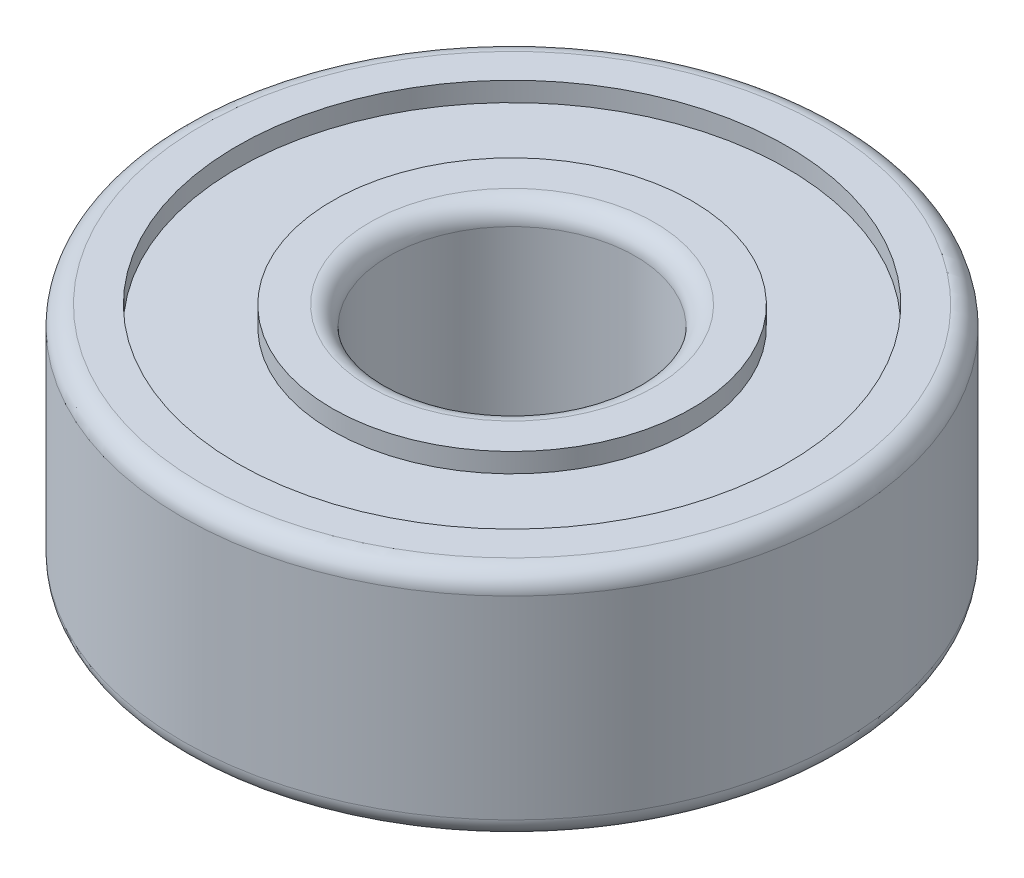
ISO-10303-21;
HEADER;
FILE_DESCRIPTION(('STEP AP214'),'2;1');
FILE_NAME('part.step','',(''),(''),'','','');
FILE_SCHEMA(('AUTOMOTIVE_DESIGN { 1 0 10303 214 1 1 1 1 }'));
ENDSEC;
DATA;
#1=APPLICATION_CONTEXT('core data for automotive mechanical design processes');
#2=APPLICATION_PROTOCOL_DEFINITION('international standard','automotive_design',2000,#1);
#3=PRODUCT_CONTEXT('',#1,'mechanical');
#4=PRODUCT('Part','Part','',(#3));
#5=PRODUCT_RELATED_PRODUCT_CATEGORY('part','',(#4));
#6=PRODUCT_DEFINITION_FORMATION('','',#4);
#7=PRODUCT_DEFINITION_CONTEXT('part definition',#1,'design');
#8=PRODUCT_DEFINITION('design','',#6,#7);
#9=PRODUCT_DEFINITION_SHAPE('','',#8);
#10=(LENGTH_UNIT() NAMED_UNIT(*) SI_UNIT(.MILLI.,.METRE.));
#11=(NAMED_UNIT(*) PLANE_ANGLE_UNIT() SI_UNIT($,.RADIAN.));
#12=(NAMED_UNIT(*) SI_UNIT($,.STERADIAN.) SOLID_ANGLE_UNIT());
#13=UNCERTAINTY_MEASURE_WITH_UNIT(LENGTH_MEASURE(1.E-05),#10,'distance_accuracy_value','');
#14=(GEOMETRIC_REPRESENTATION_CONTEXT(3) GLOBAL_UNCERTAINTY_ASSIGNED_CONTEXT((#13)) GLOBAL_UNIT_ASSIGNED_CONTEXT((#10,
#11,#12)) REPRESENTATION_CONTEXT('',''));
#15=CARTESIAN_POINT('',(0.,0.,0.));
#16=DIRECTION('',(0.,0.,1.));
#17=DIRECTION('',(1.,0.,0.));
#18=AXIS2_PLACEMENT_3D('',#15,#16,#17);
#19=CARTESIAN_POINT('',(0.,0.,0.));
#20=DIRECTION('',(0.,1.,0.));
#21=DIRECTION('',(0.,0.,1.));
#22=AXIS2_PLACEMENT_3D('',#19,#20,#21);
#23=PLANE('',#22);
#24=CARTESIAN_POINT('',(0.,0.,0.));
#25=DIRECTION('',(0.,1.,0.));
#26=DIRECTION('',(0.,0.,1.));
#27=AXIS2_PLACEMENT_3D('',#24,#25,#26);
#28=CIRCLE('',#27,7.35);
#29=CARTESIAN_POINT('',(0.,0.,7.35));
#30=VERTEX_POINT('',#29);
#31=EDGE_CURVE('E60',#30,#30,#28,.T.);
#32=ORIENTED_EDGE('',*,*,#31,.T.);
#33=EDGE_LOOP('',(#32));
#34=FACE_BOUND('',#33,.T.);
#35=CARTESIAN_POINT('',(0.,0.,0.));
#36=DIRECTION('',(0.,-1.,0.));
#37=DIRECTION('',(0.,0.,-1.));
#38=AXIS2_PLACEMENT_3D('',#35,#36,#37);
#39=CIRCLE('',#38,9.26210189702074);
#40=CARTESIAN_POINT('',(0.,0.,-9.26210189702074));
#41=VERTEX_POINT('',#40);
#42=EDGE_CURVE('E85',#41,#41,#39,.T.);
#43=ORIENTED_EDGE('',*,*,#42,.T.);
#44=EDGE_LOOP('',(#43));
#45=FACE_BOUND('',#44,.T.);
#46=ADVANCED_FACE('F34',(#34,#45),#23,.F.);
#47=CARTESIAN_POINT('',(0.,12.,0.));
#48=DIRECTION('',(0.,1.,0.));
#49=DIRECTION('',(0.,0.,1.));
#50=AXIS2_PLACEMENT_3D('',#47,#48,#49);
#51=PLANE('',#50);
#52=CARTESIAN_POINT('',(0.,12.,0.));
#53=DIRECTION('',(0.,1.,0.));
#54=DIRECTION('',(0.,0.,1.));
#55=AXIS2_PLACEMENT_3D('',#52,#53,#54);
#56=CIRCLE('',#55,7.35);
#57=CARTESIAN_POINT('',(0.,12.,7.35));
#58=VERTEX_POINT('',#57);
#59=EDGE_CURVE('E45',#58,#58,#56,.F.);
#60=ORIENTED_EDGE('',*,*,#59,.T.);
#61=EDGE_LOOP('',(#60));
#62=FACE_BOUND('',#61,.T.);
#63=CARTESIAN_POINT('',(0.,12.,0.));
#64=DIRECTION('',(0.,1.,0.));
#65=DIRECTION('',(0.,0.,1.));
#66=AXIS2_PLACEMENT_3D('',#63,#64,#65);
#67=CIRCLE('',#66,9.27654423559755);
#68=CARTESIAN_POINT('',(0.,12.,9.27654423559755));
#69=VERTEX_POINT('',#68);
#70=EDGE_CURVE('E73',#69,#69,#67,.T.);
#71=ORIENTED_EDGE('',*,*,#70,.T.);
#72=EDGE_LOOP('',(#71));
#73=FACE_BOUND('',#72,.T.);
#74=ADVANCED_FACE('F129',(#62,#73),#51,.T.);
#75=CARTESIAN_POINT('',(0.,12.,0.));
#76=DIRECTION('',(0.,1.,0.));
#77=DIRECTION('',(0.,0.,1.));
#78=AXIS2_PLACEMENT_3D('',#75,#76,#77);
#79=CIRCLE('',#78,14.1790857958153);
#80=CARTESIAN_POINT('',(0.,12.,14.1790857958153));
#81=VERTEX_POINT('',#80);
#82=EDGE_CURVE('E67',#81,#81,#79,.T.);
#83=ORIENTED_EDGE('',*,*,#82,.F.);
#84=EDGE_LOOP('',(#83));
#85=FACE_BOUND('',#84,.T.);
#86=CARTESIAN_POINT('',(0.,12.,0.));
#87=DIRECTION('',(0.,1.,0.));
#88=DIRECTION('',(0.,0.,1.));
#89=AXIS2_PLACEMENT_3D('',#86,#87,#88);
#90=CIRCLE('',#89,16.);
#91=CARTESIAN_POINT('',(0.,12.,16.));
#92=VERTEX_POINT('',#91);
#93=EDGE_CURVE('E49',#92,#92,#90,.T.);
#94=ORIENTED_EDGE('',*,*,#93,.T.);
#95=EDGE_LOOP('',(#94));
#96=FACE_BOUND('',#95,.T.);
#97=ADVANCED_FACE('F111',(#85,#96),#51,.T.);
#98=CARTESIAN_POINT('',(0.,0.,0.));
#99=DIRECTION('',(0.,-1.,0.));
#100=DIRECTION('',(0.,0.,-1.));
#101=AXIS2_PLACEMENT_3D('',#98,#99,#100);
#102=CIRCLE('',#101,14.4720194655175);
#103=CARTESIAN_POINT('',(0.,0.,-14.4720194655175));
#104=VERTEX_POINT('',#103);
#105=EDGE_CURVE('E79',#104,#104,#102,.T.);
#106=ORIENTED_EDGE('',*,*,#105,.F.);
#107=EDGE_LOOP('',(#106));
#108=FACE_BOUND('',#107,.T.);
#109=CARTESIAN_POINT('',(0.,0.,0.));
#110=DIRECTION('',(0.,1.,0.));
#111=DIRECTION('',(0.,0.,1.));
#112=AXIS2_PLACEMENT_3D('',#109,#110,#111);
#113=CIRCLE('',#112,16.);
#114=CARTESIAN_POINT('',(0.,0.,16.));
#115=VERTEX_POINT('',#114);
#116=EDGE_CURVE('E63',#115,#115,#113,.F.);
#117=ORIENTED_EDGE('',*,*,#116,.T.);
#118=EDGE_LOOP('',(#117));
#119=FACE_BOUND('',#118,.T.);
#120=ADVANCED_FACE('F107',(#108,#119),#23,.F.);
#121=CARTESIAN_POINT('',(0.,12.,0.));
#122=DIRECTION('',(0.,-1.,0.));
#123=DIRECTION('',(0.,0.,-1.));
#124=AXIS2_PLACEMENT_3D('',#121,#122,#123);
#125=CYLINDRICAL_SURFACE('',#124,17.);
#126=CARTESIAN_POINT('',(0.,1.,0.));
#127=DIRECTION('',(0.,1.,0.));
#128=DIRECTION('',(0.,0.,1.));
#129=AXIS2_PLACEMENT_3D('',#126,#127,#128);
#130=CIRCLE('',#129,17.);
#131=CARTESIAN_POINT('',(0.,1.,17.));
#132=VERTEX_POINT('',#131);
#133=EDGE_CURVE('E10',#132,#132,#130,.T.);
#134=ORIENTED_EDGE('',*,*,#133,.T.);
#135=EDGE_LOOP('',(#134));
#136=FACE_BOUND('',#135,.T.);
#137=CARTESIAN_POINT('',(0.,11.,0.));
#138=DIRECTION('',(0.,1.,0.));
#139=DIRECTION('',(0.,0.,1.));
#140=AXIS2_PLACEMENT_3D('',#137,#138,#139);
#141=CIRCLE('',#140,17.);
#142=CARTESIAN_POINT('',(0.,11.,17.));
#143=VERTEX_POINT('',#142);
#144=EDGE_CURVE('E41',#143,#143,#141,.F.);
#145=ORIENTED_EDGE('',*,*,#144,.T.);
#146=EDGE_LOOP('',(#145));
#147=FACE_BOUND('',#146,.T.);
#148=ADVANCED_FACE('F110',(#136,#147),#125,.T.);
#149=CARTESIAN_POINT('',(0.,12.,0.));
#150=DIRECTION('',(0.,-1.,0.));
#151=DIRECTION('',(0.,0.,-1.));
#152=AXIS2_PLACEMENT_3D('',#149,#150,#151);
#153=CYLINDRICAL_SURFACE('',#152,6.35);
#154=CARTESIAN_POINT('',(0.,1.,0.));
#155=DIRECTION('',(0.,1.,0.));
#156=DIRECTION('',(0.,0.,1.));
#157=AXIS2_PLACEMENT_3D('',#154,#155,#156);
#158=CIRCLE('',#157,6.35);
#159=CARTESIAN_POINT('',(0.,1.,6.35));
#160=VERTEX_POINT('',#159);
#161=EDGE_CURVE('E54',#160,#160,#158,.F.);
#162=ORIENTED_EDGE('',*,*,#161,.T.);
#163=EDGE_LOOP('',(#162));
#164=FACE_BOUND('',#163,.T.);
#165=CARTESIAN_POINT('',(0.,11.,0.));
#166=DIRECTION('',(0.,1.,0.));
#167=DIRECTION('',(0.,0.,1.));
#168=AXIS2_PLACEMENT_3D('',#165,#166,#167);
#169=CIRCLE('',#168,6.35);
#170=CARTESIAN_POINT('',(0.,11.,6.35));
#171=VERTEX_POINT('',#170);
#172=EDGE_CURVE('E57',#171,#171,#169,.T.);
#173=ORIENTED_EDGE('',*,*,#172,.T.);
#174=EDGE_LOOP('',(#173));
#175=FACE_BOUND('',#174,.T.);
#176=ADVANCED_FACE('F141',(#164,#175),#153,.F.);
#177=CARTESIAN_POINT('',(0.,1.,0.));
#178=DIRECTION('',(0.,1.,0.));
#179=DIRECTION('',(0.,0.,1.));
#180=AXIS2_PLACEMENT_3D('',#177,#178,#179);
#181=TOROIDAL_SURFACE('',#180,7.35,1.);
#182=ORIENTED_EDGE('',*,*,#161,.F.);
#183=EDGE_LOOP('',(#182));
#184=FACE_BOUND('',#183,.T.);
#185=ORIENTED_EDGE('',*,*,#31,.F.);
#186=EDGE_LOOP('',(#185));
#187=FACE_BOUND('',#186,.T.);
#188=ADVANCED_FACE('F125',(#184,#187),#181,.T.);
#189=CARTESIAN_POINT('',(0.,11.,0.));
#190=DIRECTION('',(0.,1.,0.));
#191=DIRECTION('',(0.,0.,1.));
#192=AXIS2_PLACEMENT_3D('',#189,#190,#191);
#193=TOROIDAL_SURFACE('',#192,7.35,1.);
#194=ORIENTED_EDGE('',*,*,#59,.F.);
#195=EDGE_LOOP('',(#194));
#196=FACE_BOUND('',#195,.T.);
#197=ORIENTED_EDGE('',*,*,#172,.F.);
#198=EDGE_LOOP('',(#197));
#199=FACE_BOUND('',#198,.T.);
#200=ADVANCED_FACE('F118',(#196,#199),#193,.T.);
#201=CARTESIAN_POINT('',(0.,1.,0.));
#202=DIRECTION('',(0.,1.,0.));
#203=DIRECTION('',(0.,0.,1.));
#204=AXIS2_PLACEMENT_3D('',#201,#202,#203);
#205=TOROIDAL_SURFACE('',#204,16.,1.);
#206=ORIENTED_EDGE('',*,*,#116,.F.);
#207=EDGE_LOOP('',(#206));
#208=FACE_BOUND('',#207,.T.);
#209=ORIENTED_EDGE('',*,*,#133,.F.);
#210=EDGE_LOOP('',(#209));
#211=FACE_BOUND('',#210,.T.);
#212=ADVANCED_FACE('F115',(#208,#211),#205,.T.);
#213=CARTESIAN_POINT('',(0.,11.,0.));
#214=DIRECTION('',(0.,1.,0.));
#215=DIRECTION('',(0.,0.,1.));
#216=AXIS2_PLACEMENT_3D('',#213,#214,#215);
#217=TOROIDAL_SURFACE('',#216,16.,1.);
#218=ORIENTED_EDGE('',*,*,#144,.F.);
#219=EDGE_LOOP('',(#218));
#220=FACE_BOUND('',#219,.T.);
#221=ORIENTED_EDGE('',*,*,#93,.F.);
#222=EDGE_LOOP('',(#221));
#223=FACE_BOUND('',#222,.T.);
#224=ADVANCED_FACE('F36',(#220,#223),#217,.T.);
#225=CARTESIAN_POINT('',(0.,11.,0.));
#226=DIRECTION('',(0.,1.,0.));
#227=DIRECTION('',(0.,0.,1.));
#228=AXIS2_PLACEMENT_3D('',#225,#226,#227);
#229=CYLINDRICAL_SURFACE('',#228,14.1790857958153);
#230=CARTESIAN_POINT('',(0.,11.,0.));
#231=DIRECTION('',(0.,1.,0.));
#232=DIRECTION('',(0.,0.,1.));
#233=AXIS2_PLACEMENT_3D('',#230,#231,#232);
#234=CIRCLE('',#233,14.1790857958153);
#235=CARTESIAN_POINT('',(0.,11.,14.1790857958153));
#236=VERTEX_POINT('',#235);
#237=EDGE_CURVE('E66',#236,#236,#234,.T.);
#238=ORIENTED_EDGE('',*,*,#237,.F.);
#239=EDGE_LOOP('',(#238));
#240=FACE_BOUND('',#239,.T.);
#241=ORIENTED_EDGE('',*,*,#82,.T.);
#242=EDGE_LOOP('',(#241));
#243=FACE_BOUND('',#242,.T.);
#244=ADVANCED_FACE('F123',(#240,#243),#229,.F.);
#245=CARTESIAN_POINT('',(0.,11.,0.));
#246=DIRECTION('',(0.,1.,0.));
#247=DIRECTION('',(0.,0.,1.));
#248=AXIS2_PLACEMENT_3D('',#245,#246,#247);
#249=PLANE('',#248);
#250=CARTESIAN_POINT('',(0.,11.,0.));
#251=DIRECTION('',(0.,1.,0.));
#252=DIRECTION('',(0.,0.,1.));
#253=AXIS2_PLACEMENT_3D('',#250,#251,#252);
#254=CIRCLE('',#253,9.27654423559755);
#255=CARTESIAN_POINT('',(0.,11.,9.27654423559755));
#256=VERTEX_POINT('',#255);
#257=EDGE_CURVE('E70',#256,#256,#254,.T.);
#258=ORIENTED_EDGE('',*,*,#257,.F.);
#259=EDGE_LOOP('',(#258));
#260=FACE_BOUND('',#259,.T.);
#261=ORIENTED_EDGE('',*,*,#237,.T.);
#262=EDGE_LOOP('',(#261));
#263=FACE_BOUND('',#262,.T.);
#264=ADVANCED_FACE('F159',(#260,#263),#249,.T.);
#265=CARTESIAN_POINT('',(0.,11.,0.));
#266=DIRECTION('',(0.,1.,0.));
#267=DIRECTION('',(0.,0.,1.));
#268=AXIS2_PLACEMENT_3D('',#265,#266,#267);
#269=CYLINDRICAL_SURFACE('',#268,9.27654423559755);
#270=ORIENTED_EDGE('',*,*,#257,.T.);
#271=EDGE_LOOP('',(#270));
#272=FACE_BOUND('',#271,.T.);
#273=ORIENTED_EDGE('',*,*,#70,.F.);
#274=EDGE_LOOP('',(#273));
#275=FACE_BOUND('',#274,.T.);
#276=ADVANCED_FACE('F103',(#272,#275),#269,.T.);
#277=CARTESIAN_POINT('',(0.,1.,0.));
#278=DIRECTION('',(0.,-1.,0.));
#279=DIRECTION('',(0.,0.,-1.));
#280=AXIS2_PLACEMENT_3D('',#277,#278,#279);
#281=CYLINDRICAL_SURFACE('',#280,14.4720194655175);
#282=CARTESIAN_POINT('',(0.,1.,0.));
#283=DIRECTION('',(0.,-1.,0.));
#284=DIRECTION('',(0.,0.,-1.));
#285=AXIS2_PLACEMENT_3D('',#282,#283,#284);
#286=CIRCLE('',#285,14.4720194655175);
#287=CARTESIAN_POINT('',(0.,1.,-14.4720194655175));
#288=VERTEX_POINT('',#287);
#289=EDGE_CURVE('E76',#288,#288,#286,.T.);
#290=ORIENTED_EDGE('',*,*,#289,.F.);
#291=EDGE_LOOP('',(#290));
#292=FACE_BOUND('',#291,.T.);
#293=ORIENTED_EDGE('',*,*,#105,.T.);
#294=EDGE_LOOP('',(#293));
#295=FACE_BOUND('',#294,.T.);
#296=ADVANCED_FACE('F97',(#292,#295),#281,.F.);
#297=CARTESIAN_POINT('',(0.,1.,0.));
#298=DIRECTION('',(0.,-1.,0.));
#299=DIRECTION('',(0.,0.,-1.));
#300=AXIS2_PLACEMENT_3D('',#297,#298,#299);
#301=PLANE('',#300);
#302=CARTESIAN_POINT('',(0.,1.,0.));
#303=DIRECTION('',(0.,-1.,0.));
#304=DIRECTION('',(0.,0.,-1.));
#305=AXIS2_PLACEMENT_3D('',#302,#303,#304);
#306=CIRCLE('',#305,9.26210189702074);
#307=CARTESIAN_POINT('',(0.,1.,-9.26210189702074));
#308=VERTEX_POINT('',#307);
#309=EDGE_CURVE('E82',#308,#308,#306,.T.);
#310=ORIENTED_EDGE('',*,*,#309,.F.);
#311=EDGE_LOOP('',(#310));
#312=FACE_BOUND('',#311,.T.);
#313=ORIENTED_EDGE('',*,*,#289,.T.);
#314=EDGE_LOOP('',(#313));
#315=FACE_BOUND('',#314,.T.);
#316=ADVANCED_FACE('F94',(#312,#315),#301,.T.);
#317=CARTESIAN_POINT('',(0.,1.,0.));
#318=DIRECTION('',(0.,-1.,0.));
#319=DIRECTION('',(0.,0.,-1.));
#320=AXIS2_PLACEMENT_3D('',#317,#318,#319);
#321=CYLINDRICAL_SURFACE('',#320,9.26210189702074);
#322=ORIENTED_EDGE('',*,*,#309,.T.);
#323=EDGE_LOOP('',(#322));
#324=FACE_BOUND('',#323,.T.);
#325=ORIENTED_EDGE('',*,*,#42,.F.);
#326=EDGE_LOOP('',(#325));
#327=FACE_BOUND('',#326,.T.);
#328=ADVANCED_FACE('F91',(#324,#327),#321,.T.);
#329=CLOSED_SHELL('',(#46,#74,#97,#120,#148,#176,#188,#200,#212,#224,#244,#264,#276,#296,#316,#328));
#330=MANIFOLD_SOLID_BREP('B2',#329);
#331=ADVANCED_BREP_SHAPE_REPRESENTATION('',(#18,#330),#14);
#332=SHAPE_DEFINITION_REPRESENTATION(#9,#331);
ENDSEC;
END-ISO-10303-21;
